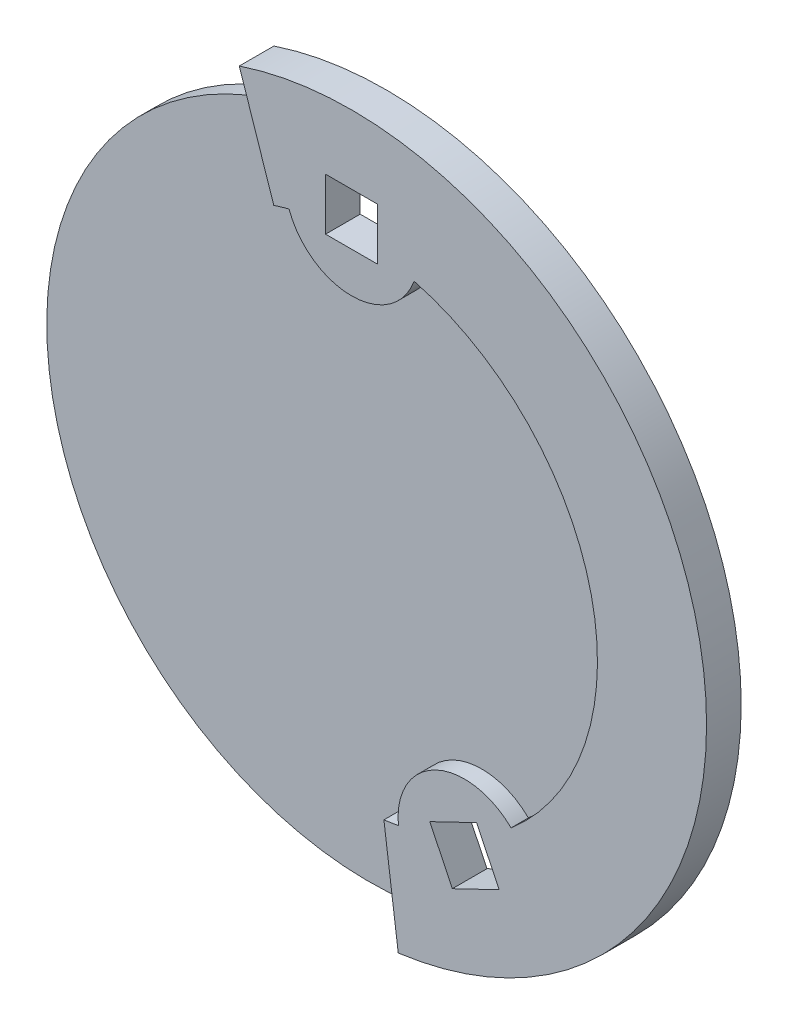
ISO-10303-21;
HEADER;
FILE_DESCRIPTION(('STEP AP214'),'2;1');
FILE_NAME('part.step','',(''),(''),'','','');
FILE_SCHEMA(('AUTOMOTIVE_DESIGN { 1 0 10303 214 1 1 1 1 }'));
ENDSEC;
DATA;
#1=APPLICATION_CONTEXT('core data for automotive mechanical design processes');
#2=APPLICATION_PROTOCOL_DEFINITION('international standard','automotive_design',2000,#1);
#3=PRODUCT_CONTEXT('',#1,'mechanical');
#4=PRODUCT('Part','Part','',(#3));
#5=PRODUCT_RELATED_PRODUCT_CATEGORY('part','',(#4));
#6=PRODUCT_DEFINITION_FORMATION('','',#4);
#7=PRODUCT_DEFINITION_CONTEXT('part definition',#1,'design');
#8=PRODUCT_DEFINITION('design','',#6,#7);
#9=PRODUCT_DEFINITION_SHAPE('','',#8);
#10=(LENGTH_UNIT() NAMED_UNIT(*) SI_UNIT(.MILLI.,.METRE.));
#11=(NAMED_UNIT(*) PLANE_ANGLE_UNIT() SI_UNIT($,.RADIAN.));
#12=(NAMED_UNIT(*) SI_UNIT($,.STERADIAN.) SOLID_ANGLE_UNIT());
#13=UNCERTAINTY_MEASURE_WITH_UNIT(LENGTH_MEASURE(1.E-05),#10,'distance_accuracy_value','');
#14=(GEOMETRIC_REPRESENTATION_CONTEXT(3) GLOBAL_UNCERTAINTY_ASSIGNED_CONTEXT((#13)) GLOBAL_UNIT_ASSIGNED_CONTEXT((#10,
#11,#12)) REPRESENTATION_CONTEXT('',''));
#15=CARTESIAN_POINT('',(0.,0.,0.));
#16=DIRECTION('',(0.,0.,1.));
#17=DIRECTION('',(1.,0.,0.));
#18=AXIS2_PLACEMENT_3D('',#15,#16,#17);
#19=CARTESIAN_POINT('',(0.,0.,1.));
#20=DIRECTION('',(-0.948679561183961,-0.316238976395711,0.));
#21=DIRECTION('',(0.316238976395711,-0.948679561183961,0.));
#22=AXIS2_PLACEMENT_3D('',#19,#20,#21);
#23=PLANE('',#22);
#24=DIRECTION('',(-0.316238976395711,0.948679561183961,0.));
#25=VECTOR('',#24,1.);
#26=CARTESIAN_POINT('',(0.,0.,0.));
#27=LINE('',#26,#25);
#28=CARTESIAN_POINT('',(-5.88204496096024,17.6454398380217,0.));
#29=VERTEX_POINT('',#28);
#30=CARTESIAN_POINT('',(-6.48289901611209,19.4479310042712,0.));
#31=VERTEX_POINT('',#30);
#32=EDGE_CURVE('E309',#29,#31,#27,.T.);
#33=ORIENTED_EDGE('',*,*,#32,.F.);
#34=DIRECTION('',(0.,0.,-1.));
#35=VECTOR('',#34,1.);
#36=CARTESIAN_POINT('',(-5.88204496096024,17.6454398380217,1.));
#37=LINE('',#36,#35);
#38=CARTESIAN_POINT('',(-5.88204496096024,17.6454398380217,1.));
#39=VERTEX_POINT('',#38);
#40=EDGE_CURVE('E311',#39,#29,#37,.T.);
#41=ORIENTED_EDGE('',*,*,#40,.F.);
#42=DIRECTION('',(0.316238976395712,-0.948679561183961,0.));
#43=VECTOR('',#42,1.);
#44=CARTESIAN_POINT('',(-4.49059346481916,13.4712497688124,1.));
#45=LINE('',#44,#43);
#46=CARTESIAN_POINT('',(-4.49059346481916,13.4712497688124,1.));
#47=VERTEX_POINT('',#46);
#48=EDGE_CURVE('E267',#39,#47,#45,.T.);
#49=ORIENTED_EDGE('',*,*,#48,.T.);
#50=DIRECTION('',(0.,0.,-1.));
#51=VECTOR('',#50,1.);
#52=CARTESIAN_POINT('',(-4.49059346481916,13.4712497688124,2.));
#53=LINE('',#52,#51);
#54=CARTESIAN_POINT('',(-4.49059346481916,13.4712497688124,2.));
#55=VERTEX_POINT('',#54);
#56=EDGE_CURVE('E234',#55,#47,#53,.T.);
#57=ORIENTED_EDGE('',*,*,#56,.F.);
#58=DIRECTION('',(0.316238976395712,-0.948679561183961,0.));
#59=VECTOR('',#58,1.);
#60=CARTESIAN_POINT('',(-4.49059346481916,13.4712497688124,2.));
#61=LINE('',#60,#59);
#62=CARTESIAN_POINT('',(-6.48289901611209,19.4479310042712,2.));
#63=VERTEX_POINT('',#62);
#64=EDGE_CURVE('E232',#63,#55,#61,.T.);
#65=ORIENTED_EDGE('',*,*,#64,.F.);
#66=DIRECTION('',(0.,0.,-1.));
#67=VECTOR('',#66,1.);
#68=CARTESIAN_POINT('',(-6.48289901611209,19.4479310042712,1.));
#69=LINE('',#68,#67);
#70=EDGE_CURVE('E314',#63,#31,#69,.T.);
#71=ORIENTED_EDGE('',*,*,#70,.T.);
#72=EDGE_LOOP('',(#33,#41,#49,#57,#65,#71));
#73=FACE_BOUND('',#72,.T.);
#74=ADVANCED_FACE('F37',(#73),#23,.T.);
#75=CARTESIAN_POINT('',(0.,0.,1.));
#76=DIRECTION('',(0.,0.,-1.));
#77=DIRECTION('',(-1.,0.,0.));
#78=AXIS2_PLACEMENT_3D('',#75,#76,#77);
#79=CYLINDRICAL_SURFACE('',#78,18.6);
#80=CARTESIAN_POINT('',(0.,0.,0.));
#81=DIRECTION('',(0.,0.,1.));
#82=DIRECTION('',(1.,0.,0.));
#83=AXIS2_PLACEMENT_3D('',#80,#81,#82);
#84=CIRCLE('',#83,18.6);
#85=CARTESIAN_POINT('',(2.35653002586721,-18.4501156158216,0.));
#86=VERTEX_POINT('',#85);
#87=EDGE_CURVE('E319',#29,#86,#84,.T.);
#88=ORIENTED_EDGE('',*,*,#87,.T.);
#89=DIRECTION('',(0.,0.,-1.));
#90=VECTOR('',#89,1.);
#91=CARTESIAN_POINT('',(2.35653002586721,-18.4501156158216,1.));
#92=LINE('',#91,#90);
#93=CARTESIAN_POINT('',(2.35653002586721,-18.4501156158216,1.));
#94=VERTEX_POINT('',#93);
#95=EDGE_CURVE('E340',#94,#86,#92,.T.);
#96=ORIENTED_EDGE('',*,*,#95,.F.);
#97=CARTESIAN_POINT('',(0.,0.,1.));
#98=DIRECTION('',(0.,0.,1.));
#99=DIRECTION('',(1.,0.,0.));
#100=AXIS2_PLACEMENT_3D('',#97,#98,#99);
#101=CIRCLE('',#100,18.6);
#102=EDGE_CURVE('E334',#39,#94,#101,.T.);
#103=ORIENTED_EDGE('',*,*,#102,.F.);
#104=ORIENTED_EDGE('',*,*,#40,.T.);
#105=EDGE_LOOP('',(#88,#96,#103,#104));
#106=FACE_BOUND('',#105,.T.);
#107=ADVANCED_FACE('F299',(#106),#79,.T.);
#108=CARTESIAN_POINT('',(0.,0.,1.));
#109=DIRECTION('',(0.991941699775358,0.126695162681033,0.));
#110=DIRECTION('',(-0.126695162681033,0.991941699775358,0.));
#111=AXIS2_PLACEMENT_3D('',#108,#109,#110);
#112=PLANE('',#111);
#113=DIRECTION('',(0.126695162681033,-0.991941699775358,0.));
#114=VECTOR('',#113,1.);
#115=CARTESIAN_POINT('',(0.,0.,0.));
#116=LINE('',#115,#114);
#117=CARTESIAN_POINT('',(2.59725083496118,-20.3348048453948,0.));
#118=VERTEX_POINT('',#117);
#119=EDGE_CURVE('E322',#86,#118,#116,.T.);
#120=ORIENTED_EDGE('',*,*,#119,.T.);
#121=DIRECTION('',(0.,0.,-1.));
#122=VECTOR('',#121,1.);
#123=CARTESIAN_POINT('',(2.59725083496118,-20.3348048453948,1.));
#124=LINE('',#123,#122);
#125=CARTESIAN_POINT('',(2.59725083496118,-20.3348048453948,1.));
#126=VERTEX_POINT('',#125);
#127=EDGE_CURVE('E336',#126,#118,#124,.T.);
#128=ORIENTED_EDGE('',*,*,#127,.F.);
#129=DIRECTION('',(0.126695162681033,-0.991941699775358,0.));
#130=VECTOR('',#129,1.);
#131=CARTESIAN_POINT('',(0.,0.,1.));
#132=LINE('',#131,#130);
#133=EDGE_CURVE('E344',#94,#126,#132,.T.);
#134=ORIENTED_EDGE('',*,*,#133,.F.);
#135=ORIENTED_EDGE('',*,*,#95,.T.);
#136=EDGE_LOOP('',(#120,#128,#134,#135));
#137=FACE_BOUND('',#136,.T.);
#138=ADVANCED_FACE('F304',(#137),#112,.F.);
#139=CARTESIAN_POINT('',(0.,0.,1.));
#140=DIRECTION('',(0.,0.,-1.));
#141=DIRECTION('',(-1.,0.,0.));
#142=AXIS2_PLACEMENT_3D('',#139,#140,#141);
#143=CYLINDRICAL_SURFACE('',#142,20.5);
#144=CARTESIAN_POINT('',(0.,0.,0.));
#145=DIRECTION('',(0.,0.,1.));
#146=DIRECTION('',(1.,0.,0.));
#147=AXIS2_PLACEMENT_3D('',#144,#145,#146);
#148=CIRCLE('',#147,20.5);
#149=EDGE_CURVE('E332',#118,#31,#148,.T.);
#150=ORIENTED_EDGE('',*,*,#149,.T.);
#151=ORIENTED_EDGE('',*,*,#70,.F.);
#152=CARTESIAN_POINT('',(0.,0.,2.));
#153=DIRECTION('',(0.,0.,1.));
#154=DIRECTION('',(1.,0.,0.));
#155=AXIS2_PLACEMENT_3D('',#152,#153,#154);
#156=CIRCLE('',#155,20.5);
#157=CARTESIAN_POINT('',(2.69669306776985,-20.3218563743139,2.));
#158=VERTEX_POINT('',#157);
#159=EDGE_CURVE('E229',#158,#63,#156,.T.);
#160=ORIENTED_EDGE('',*,*,#159,.F.);
#161=DIRECTION('',(0.,0.,-1.));
#162=VECTOR('',#161,1.);
#163=CARTESIAN_POINT('',(2.69669306776985,-20.3218563743139,2.));
#164=LINE('',#163,#162);
#165=CARTESIAN_POINT('',(2.69669306776985,-20.3218563743139,1.));
#166=VERTEX_POINT('',#165);
#167=EDGE_CURVE('E258',#158,#166,#164,.T.);
#168=ORIENTED_EDGE('',*,*,#167,.T.);
#169=CARTESIAN_POINT('',(0.,0.,1.));
#170=DIRECTION('',(0.,0.,1.));
#171=DIRECTION('',(1.,0.,0.));
#172=AXIS2_PLACEMENT_3D('',#169,#170,#171);
#173=CIRCLE('',#172,20.5);
#174=EDGE_CURVE('E337',#126,#166,#173,.T.);
#175=ORIENTED_EDGE('',*,*,#174,.F.);
#176=ORIENTED_EDGE('',*,*,#127,.T.);
#177=EDGE_LOOP('',(#150,#151,#160,#168,#175,#176));
#178=FACE_BOUND('',#177,.T.);
#179=ADVANCED_FACE('F392',(#178),#143,.T.);
#180=CARTESIAN_POINT('',(0.,0.,1.));
#181=DIRECTION('',(0.,0.,1.));
#182=DIRECTION('',(1.,0.,0.));
#183=AXIS2_PLACEMENT_3D('',#180,#181,#182);
#184=PLANE('',#183);
#185=ORIENTED_EDGE('',*,*,#48,.F.);
#186=ORIENTED_EDGE('',*,*,#102,.T.);
#187=ORIENTED_EDGE('',*,*,#133,.T.);
#188=ORIENTED_EDGE('',*,*,#174,.T.);
#189=DIRECTION('',(0.131546003305846,-0.991310067039702,0.));
#190=VECTOR('',#189,1.);
#191=CARTESIAN_POINT('',(1.86795324694304,-14.0766029519639,1.));
#192=LINE('',#191,#190);
#193=CARTESIAN_POINT('',(1.86795324694304,-14.0766029519639,1.));
#194=VERTEX_POINT('',#193);
#195=EDGE_CURVE('E219',#194,#166,#192,.T.);
#196=ORIENTED_EDGE('',*,*,#195,.F.);
#197=CARTESIAN_POINT('',(0.,0.,1.));
#198=DIRECTION('',(0.,0.,-1.));
#199=DIRECTION('',(1.,0.,0.));
#200=AXIS2_PLACEMENT_3D('',#197,#198,#199);
#201=CIRCLE('',#200,14.2000000000002);
#202=CARTESIAN_POINT('',(2.70630370509862,-13.9397245401684,1.));
#203=VERTEX_POINT('',#202);
#204=EDGE_CURVE('E246',#203,#194,#201,.T.);
#205=ORIENTED_EDGE('',*,*,#204,.F.);
#206=CARTESIAN_POINT('',(6.52092011060211,-13.5408301350134,1.));
#207=DIRECTION('',(0.,0.,1.));
#208=DIRECTION('',(1.,0.,0.));
#209=AXIS2_PLACEMENT_3D('',#206,#207,#208);
#210=CIRCLE('',#209,3.83541589239033);
#211=CARTESIAN_POINT('',(9.21116274156859,-10.8071495292858,1.));
#212=VERTEX_POINT('',#211);
#213=EDGE_CURVE('E243',#212,#203,#210,.T.);
#214=ORIENTED_EDGE('',*,*,#213,.F.);
#215=CARTESIAN_POINT('',(0.,0.,1.));
#216=DIRECTION('',(0.,0.,-1.));
#217=DIRECTION('',(1.,0.,0.));
#218=AXIS2_PLACEMENT_3D('',#215,#216,#217);
#219=CIRCLE('',#218,14.2000000000002);
#220=CARTESIAN_POINT('',(3.60992442037415,13.733479008583,1.));
#221=VERTEX_POINT('',#220);
#222=EDGE_CURVE('E240',#221,#212,#219,.T.);
#223=ORIENTED_EDGE('',*,*,#222,.F.);
#224=CARTESIAN_POINT('',(3.90616358703078E-12,15.0291875972769,1.));
#225=DIRECTION('',(0.,0.,1.));
#226=DIRECTION('',(1.,0.,0.));
#227=AXIS2_PLACEMENT_3D('',#224,#225,#226);
#228=CIRCLE('',#227,3.83541589239035);
#229=CARTESIAN_POINT('',(-3.60992442036701,13.7334790085849,1.));
#230=VERTEX_POINT('',#229);
#231=EDGE_CURVE('E237',#230,#221,#228,.T.);
#232=ORIENTED_EDGE('',*,*,#231,.F.);
#233=CARTESIAN_POINT('',(0.,0.,1.));
#234=DIRECTION('',(0.,0.,-1.));
#235=DIRECTION('',(1.,0.,0.));
#236=AXIS2_PLACEMENT_3D('',#233,#234,#235);
#237=CIRCLE('',#236,14.2000000000002);
#238=EDGE_CURVE('E208',#47,#230,#237,.T.);
#239=ORIENTED_EDGE('',*,*,#238,.F.);
#240=EDGE_LOOP('',(#185,#186,#187,#188,#196,#205,#214,#223,#232,#239));
#241=FACE_BOUND('',#240,.T.);
#242=ADVANCED_FACE('F372',(#241),#184,.T.);
#243=CARTESIAN_POINT('',(0.,0.,0.));
#244=DIRECTION('',(0.,0.,1.));
#245=DIRECTION('',(1.,0.,0.));
#246=AXIS2_PLACEMENT_3D('',#243,#244,#245);
#247=PLANE('',#246);
#248=DIRECTION('',(-0.90096886790242,-0.433883739117555,0.));
#249=VECTOR('',#248,1.);
#250=CARTESIAN_POINT('',(5.82029241742415,-15.5431090455452,0.));
#251=LINE('',#250,#249);
#252=CARTESIAN_POINT('',(8.523199021134,-14.2414578281913,0.));
#253=VERTEX_POINT('',#252);
#254=CARTESIAN_POINT('',(5.82029241742415,-15.5431090455452,0.));
#255=VERTEX_POINT('',#254);
#256=EDGE_CURVE('E178',#253,#255,#251,.T.);
#257=ORIENTED_EDGE('',*,*,#256,.F.);
#258=DIRECTION('',(0.433883739117555,-0.900968867902421,0.));
#259=VECTOR('',#258,1.);
#260=CARTESIAN_POINT('',(8.523199021134,-14.2414578281913,0.));
#261=LINE('',#260,#259);
#262=CARTESIAN_POINT('',(7.22154780378009,-11.5385512244815,0.));
#263=VERTEX_POINT('',#262);
#264=EDGE_CURVE('E51',#263,#253,#261,.T.);
#265=ORIENTED_EDGE('',*,*,#264,.F.);
#266=DIRECTION('',(0.90096886790242,0.433883739117556,0.));
#267=VECTOR('',#266,1.);
#268=CARTESIAN_POINT('',(7.22154780378009,-11.5385512244815,0.));
#269=LINE('',#268,#267);
#270=CARTESIAN_POINT('',(4.51864120007024,-12.8402024418354,0.));
#271=VERTEX_POINT('',#270);
#272=EDGE_CURVE('E185',#271,#263,#269,.T.);
#273=ORIENTED_EDGE('',*,*,#272,.F.);
#274=DIRECTION('',(-0.433883739117555,0.900968867902421,0.));
#275=VECTOR('',#274,1.);
#276=CARTESIAN_POINT('',(4.51864120007024,-12.8402024418354,0.));
#277=LINE('',#276,#275);
#278=EDGE_CURVE('E169',#255,#271,#277,.T.);
#279=ORIENTED_EDGE('',*,*,#278,.F.);
#280=EDGE_LOOP('',(#257,#265,#273,#279));
#281=FACE_BOUND('',#280,.T.);
#282=DIRECTION('',(-1.,0.,0.));
#283=VECTOR('',#282,1.);
#284=CARTESIAN_POINT('',(-1.49999999999752,13.5291875972754,0.));
#285=LINE('',#284,#283);
#286=CARTESIAN_POINT('',(1.50000000000534,13.5291875972755,0.));
#287=VERTEX_POINT('',#286);
#288=CARTESIAN_POINT('',(-1.49999999999752,13.5291875972754,0.));
#289=VERTEX_POINT('',#288);
#290=EDGE_CURVE('E196',#287,#289,#285,.T.);
#291=ORIENTED_EDGE('',*,*,#290,.F.);
#292=DIRECTION('',(0.,-1.,0.));
#293=VECTOR('',#292,1.);
#294=CARTESIAN_POINT('',(1.50000000000534,13.5291875972755,0.));
#295=LINE('',#294,#293);
#296=CARTESIAN_POINT('',(1.50000000000533,16.5291875972783,0.));
#297=VERTEX_POINT('',#296);
#298=EDGE_CURVE('E192',#297,#287,#295,.T.);
#299=ORIENTED_EDGE('',*,*,#298,.F.);
#300=DIRECTION('',(1.,0.,0.));
#301=VECTOR('',#300,1.);
#302=CARTESIAN_POINT('',(1.50000000000533,16.5291875972783,0.));
#303=LINE('',#302,#301);
#304=CARTESIAN_POINT('',(-1.49999999999753,16.5291875972783,0.));
#305=VERTEX_POINT('',#304);
#306=EDGE_CURVE('E202',#305,#297,#303,.T.);
#307=ORIENTED_EDGE('',*,*,#306,.F.);
#308=DIRECTION('',(0.,1.,0.));
#309=VECTOR('',#308,1.);
#310=CARTESIAN_POINT('',(-1.49999999999753,16.5291875972783,0.));
#311=LINE('',#310,#309);
#312=EDGE_CURVE('E199',#289,#305,#311,.T.);
#313=ORIENTED_EDGE('',*,*,#312,.F.);
#314=EDGE_LOOP('',(#291,#299,#307,#313));
#315=FACE_BOUND('',#314,.T.);
#316=ORIENTED_EDGE('',*,*,#32,.T.);
#317=ORIENTED_EDGE('',*,*,#149,.F.);
#318=ORIENTED_EDGE('',*,*,#119,.F.);
#319=ORIENTED_EDGE('',*,*,#87,.F.);
#320=EDGE_LOOP('',(#316,#317,#318,#319));
#321=FACE_BOUND('',#320,.T.);
#322=ADVANCED_FACE('F182',(#281,#315,#321),#247,.F.);
#323=CARTESIAN_POINT('',(0.,0.,2.));
#324=DIRECTION('',(0.,0.,-1.));
#325=DIRECTION('',(-1.,0.,0.));
#326=AXIS2_PLACEMENT_3D('',#323,#324,#325);
#327=CYLINDRICAL_SURFACE('',#326,14.2000000000002);
#328=ORIENTED_EDGE('',*,*,#238,.T.);
#329=DIRECTION('',(0.,0.,-1.));
#330=VECTOR('',#329,1.);
#331=CARTESIAN_POINT('',(-3.60992442036701,13.7334790085849,2.));
#332=LINE('',#331,#330);
#333=CARTESIAN_POINT('',(-3.60992442036701,13.7334790085849,2.));
#334=VERTEX_POINT('',#333);
#335=EDGE_CURVE('E320',#334,#230,#332,.T.);
#336=ORIENTED_EDGE('',*,*,#335,.F.);
#337=CARTESIAN_POINT('',(0.,0.,2.));
#338=DIRECTION('',(0.,0.,-1.));
#339=DIRECTION('',(1.,0.,0.));
#340=AXIS2_PLACEMENT_3D('',#337,#338,#339);
#341=CIRCLE('',#340,14.2000000000002);
#342=EDGE_CURVE('E215',#55,#334,#341,.T.);
#343=ORIENTED_EDGE('',*,*,#342,.F.);
#344=ORIENTED_EDGE('',*,*,#56,.T.);
#345=EDGE_LOOP('',(#328,#336,#343,#344));
#346=FACE_BOUND('',#345,.T.);
#347=ADVANCED_FACE('F387',(#346),#327,.F.);
#348=CARTESIAN_POINT('',(3.90616358703078E-12,15.0291875972769,2.));
#349=DIRECTION('',(0.,0.,-1.));
#350=DIRECTION('',(-1.,0.,0.));
#351=AXIS2_PLACEMENT_3D('',#348,#349,#350);
#352=CYLINDRICAL_SURFACE('',#351,3.83541589239035);
#353=ORIENTED_EDGE('',*,*,#231,.T.);
#354=DIRECTION('',(0.,0.,-1.));
#355=VECTOR('',#354,1.);
#356=CARTESIAN_POINT('',(3.60992442037415,13.733479008583,2.));
#357=LINE('',#356,#355);
#358=CARTESIAN_POINT('',(3.60992442037415,13.733479008583,2.));
#359=VERTEX_POINT('',#358);
#360=EDGE_CURVE('E325',#359,#221,#357,.T.);
#361=ORIENTED_EDGE('',*,*,#360,.F.);
#362=CARTESIAN_POINT('',(3.90616358703078E-12,15.0291875972769,2.));
#363=DIRECTION('',(0.,0.,1.));
#364=DIRECTION('',(1.,0.,0.));
#365=AXIS2_PLACEMENT_3D('',#362,#363,#364);
#366=CIRCLE('',#365,3.83541589239035);
#367=EDGE_CURVE('E218',#334,#359,#366,.T.);
#368=ORIENTED_EDGE('',*,*,#367,.F.);
#369=ORIENTED_EDGE('',*,*,#335,.T.);
#370=EDGE_LOOP('',(#353,#361,#368,#369));
#371=FACE_BOUND('',#370,.T.);
#372=ADVANCED_FACE('F382',(#371),#352,.T.);
#373=CARTESIAN_POINT('',(0.,0.,2.));
#374=DIRECTION('',(0.,0.,-1.));
#375=DIRECTION('',(-1.,0.,0.));
#376=AXIS2_PLACEMENT_3D('',#373,#374,#375);
#377=CYLINDRICAL_SURFACE('',#376,14.2000000000002);
#378=ORIENTED_EDGE('',*,*,#222,.T.);
#379=DIRECTION('',(0.,0.,-1.));
#380=VECTOR('',#379,1.);
#381=CARTESIAN_POINT('',(9.21116274156859,-10.8071495292858,2.));
#382=LINE('',#381,#380);
#383=CARTESIAN_POINT('',(9.21116274156859,-10.8071495292858,2.));
#384=VERTEX_POINT('',#383);
#385=EDGE_CURVE('E357',#384,#212,#382,.T.);
#386=ORIENTED_EDGE('',*,*,#385,.F.);
#387=CARTESIAN_POINT('',(0.,0.,2.));
#388=DIRECTION('',(0.,0.,-1.));
#389=DIRECTION('',(1.,0.,0.));
#390=AXIS2_PLACEMENT_3D('',#387,#388,#389);
#391=CIRCLE('',#390,14.2000000000002);
#392=EDGE_CURVE('E221',#359,#384,#391,.T.);
#393=ORIENTED_EDGE('',*,*,#392,.F.);
#394=ORIENTED_EDGE('',*,*,#360,.T.);
#395=EDGE_LOOP('',(#378,#386,#393,#394));
#396=FACE_BOUND('',#395,.T.);
#397=ADVANCED_FACE('F379',(#396),#377,.F.);
#398=CARTESIAN_POINT('',(6.52092011060211,-13.5408301350134,2.));
#399=DIRECTION('',(0.,0.,-1.));
#400=DIRECTION('',(-1.,0.,0.));
#401=AXIS2_PLACEMENT_3D('',#398,#399,#400);
#402=CYLINDRICAL_SURFACE('',#401,3.83541589239033);
#403=ORIENTED_EDGE('',*,*,#213,.T.);
#404=DIRECTION('',(0.,0.,-1.));
#405=VECTOR('',#404,1.);
#406=CARTESIAN_POINT('',(2.70630370509862,-13.9397245401684,2.));
#407=LINE('',#406,#405);
#408=CARTESIAN_POINT('',(2.70630370509862,-13.9397245401684,2.));
#409=VERTEX_POINT('',#408);
#410=EDGE_CURVE('E360',#409,#203,#407,.T.);
#411=ORIENTED_EDGE('',*,*,#410,.F.);
#412=CARTESIAN_POINT('',(6.52092011060211,-13.5408301350134,2.));
#413=DIRECTION('',(0.,0.,1.));
#414=DIRECTION('',(1.,0.,0.));
#415=AXIS2_PLACEMENT_3D('',#412,#413,#414);
#416=CIRCLE('',#415,3.83541589239033);
#417=EDGE_CURVE('E223',#384,#409,#416,.T.);
#418=ORIENTED_EDGE('',*,*,#417,.F.);
#419=ORIENTED_EDGE('',*,*,#385,.T.);
#420=EDGE_LOOP('',(#403,#411,#418,#419));
#421=FACE_BOUND('',#420,.T.);
#422=ADVANCED_FACE('F374',(#421),#402,.T.);
#423=CARTESIAN_POINT('',(0.,0.,2.));
#424=DIRECTION('',(0.,0.,-1.));
#425=DIRECTION('',(-1.,0.,0.));
#426=AXIS2_PLACEMENT_3D('',#423,#424,#425);
#427=CYLINDRICAL_SURFACE('',#426,14.2000000000002);
#428=ORIENTED_EDGE('',*,*,#204,.T.);
#429=DIRECTION('',(0.,0.,-1.));
#430=VECTOR('',#429,1.);
#431=CARTESIAN_POINT('',(1.86795324694304,-14.0766029519639,2.));
#432=LINE('',#431,#430);
#433=CARTESIAN_POINT('',(1.86795324694304,-14.0766029519639,2.));
#434=VERTEX_POINT('',#433);
#435=EDGE_CURVE('E261',#434,#194,#432,.T.);
#436=ORIENTED_EDGE('',*,*,#435,.F.);
#437=CARTESIAN_POINT('',(0.,0.,2.));
#438=DIRECTION('',(0.,0.,-1.));
#439=DIRECTION('',(1.,0.,0.));
#440=AXIS2_PLACEMENT_3D('',#437,#438,#439);
#441=CIRCLE('',#440,14.2000000000002);
#442=EDGE_CURVE('E225',#409,#434,#441,.T.);
#443=ORIENTED_EDGE('',*,*,#442,.F.);
#444=ORIENTED_EDGE('',*,*,#410,.T.);
#445=EDGE_LOOP('',(#428,#436,#443,#444));
#446=FACE_BOUND('',#445,.T.);
#447=ADVANCED_FACE('F370',(#446),#427,.F.);
#448=CARTESIAN_POINT('',(1.86795324694304,-14.0766029519639,2.));
#449=DIRECTION('',(0.991310067039702,0.131546003305846,0.));
#450=DIRECTION('',(-0.131546003305846,0.991310067039702,0.));
#451=AXIS2_PLACEMENT_3D('',#448,#449,#450);
#452=PLANE('',#451);
#453=ORIENTED_EDGE('',*,*,#195,.T.);
#454=ORIENTED_EDGE('',*,*,#167,.F.);
#455=DIRECTION('',(0.131546003305846,-0.991310067039702,0.));
#456=VECTOR('',#455,1.);
#457=CARTESIAN_POINT('',(1.86795324694304,-14.0766029519639,2.));
#458=LINE('',#457,#456);
#459=EDGE_CURVE('E227',#434,#158,#458,.T.);
#460=ORIENTED_EDGE('',*,*,#459,.F.);
#461=ORIENTED_EDGE('',*,*,#435,.T.);
#462=EDGE_LOOP('',(#453,#454,#460,#461));
#463=FACE_BOUND('',#462,.T.);
#464=ADVANCED_FACE('F366',(#463),#452,.F.);
#465=CARTESIAN_POINT('',(0.,0.,2.));
#466=DIRECTION('',(0.,0.,1.));
#467=DIRECTION('',(1.,0.,0.));
#468=AXIS2_PLACEMENT_3D('',#465,#466,#467);
#469=PLANE('',#468);
#470=DIRECTION('',(-0.433883739117555,0.900968867902421,0.));
#471=VECTOR('',#470,1.);
#472=CARTESIAN_POINT('',(1.35145330185137,0.650825608675243,2.));
#473=LINE('',#472,#471);
#474=CARTESIAN_POINT('',(8.523199021134,-14.2414578281913,2.));
#475=VERTEX_POINT('',#474);
#476=CARTESIAN_POINT('',(7.22154780378009,-11.5385512244815,2.));
#477=VERTEX_POINT('',#476);
#478=EDGE_CURVE('E11',#475,#477,#473,.T.);
#479=ORIENTED_EDGE('',*,*,#478,.F.);
#480=DIRECTION('',(0.900968867902421,0.433883739117555,0.));
#481=VECTOR('',#480,1.);
#482=CARTESIAN_POINT('',(7.17174571928263,-14.8922834368666,2.));
#483=LINE('',#482,#481);
#484=CARTESIAN_POINT('',(5.82029241742415,-15.5431090455452,2.));
#485=VERTEX_POINT('',#484);
#486=EDGE_CURVE('E274',#485,#475,#483,.T.);
#487=ORIENTED_EDGE('',*,*,#486,.F.);
#488=DIRECTION('',(0.433883739117555,-0.900968867902421,0.));
#489=VECTOR('',#488,1.);
#490=CARTESIAN_POINT('',(-1.35145330185848,-0.650825608678668,2.));
#491=LINE('',#490,#489);
#492=CARTESIAN_POINT('',(4.51864120007024,-12.8402024418354,2.));
#493=VERTEX_POINT('',#492);
#494=EDGE_CURVE('E172',#493,#485,#491,.T.);
#495=ORIENTED_EDGE('',*,*,#494,.F.);
#496=DIRECTION('',(-0.90096886790242,-0.433883739117556,0.));
#497=VECTOR('',#496,1.);
#498=CARTESIAN_POINT('',(5.87009450192873,-12.1893768331567,2.));
#499=LINE('',#498,#497);
#500=EDGE_CURVE('E44',#477,#493,#499,.T.);
#501=ORIENTED_EDGE('',*,*,#500,.F.);
#502=EDGE_LOOP('',(#479,#487,#495,#501));
#503=FACE_BOUND('',#502,.T.);
#504=DIRECTION('',(0.,1.,0.));
#505=VECTOR('',#504,1.);
#506=CARTESIAN_POINT('',(1.50000000000538,0.,2.));
#507=LINE('',#506,#505);
#508=CARTESIAN_POINT('',(1.50000000000534,13.5291875972755,2.));
#509=VERTEX_POINT('',#508);
#510=CARTESIAN_POINT('',(1.50000000000533,16.5291875972783,2.));
#511=VERTEX_POINT('',#510);
#512=EDGE_CURVE('E272',#509,#511,#507,.T.);
#513=ORIENTED_EDGE('',*,*,#512,.F.);
#514=DIRECTION('',(1.,0.,0.));
#515=VECTOR('',#514,1.);
#516=CARTESIAN_POINT('',(0.,13.5291875972755,2.));
#517=LINE('',#516,#515);
#518=CARTESIAN_POINT('',(-1.49999999999752,13.5291875972754,2.));
#519=VERTEX_POINT('',#518);
#520=EDGE_CURVE('E264',#519,#509,#517,.T.);
#521=ORIENTED_EDGE('',*,*,#520,.F.);
#522=DIRECTION('',(0.,-1.,0.));
#523=VECTOR('',#522,1.);
#524=CARTESIAN_POINT('',(-1.49999999999749,0.,2.));
#525=LINE('',#524,#523);
#526=CARTESIAN_POINT('',(-1.49999999999753,16.5291875972783,2.));
#527=VERTEX_POINT('',#526);
#528=EDGE_CURVE('E266',#527,#519,#525,.T.);
#529=ORIENTED_EDGE('',*,*,#528,.F.);
#530=DIRECTION('',(-1.,0.,0.));
#531=VECTOR('',#530,1.);
#532=CARTESIAN_POINT('',(0.,16.5291875972783,2.));
#533=LINE('',#532,#531);
#534=EDGE_CURVE('E270',#511,#527,#533,.T.);
#535=ORIENTED_EDGE('',*,*,#534,.F.);
#536=EDGE_LOOP('',(#513,#521,#529,#535));
#537=FACE_BOUND('',#536,.T.);
#538=ORIENTED_EDGE('',*,*,#342,.T.);
#539=ORIENTED_EDGE('',*,*,#367,.T.);
#540=ORIENTED_EDGE('',*,*,#392,.T.);
#541=ORIENTED_EDGE('',*,*,#417,.T.);
#542=ORIENTED_EDGE('',*,*,#442,.T.);
#543=ORIENTED_EDGE('',*,*,#459,.T.);
#544=ORIENTED_EDGE('',*,*,#159,.T.);
#545=ORIENTED_EDGE('',*,*,#64,.T.);
#546=EDGE_LOOP('',(#538,#539,#540,#541,#542,#543,#544,#545));
#547=FACE_BOUND('',#546,.T.);
#548=ADVANCED_FACE('F282',(#503,#537,#547),#469,.T.);
#549=CARTESIAN_POINT('',(1.50000000000534,13.5291875972755,2.000025));
#550=DIRECTION('',(1.,0.,0.));
#551=DIRECTION('',(0.,1.,0.));
#552=AXIS2_PLACEMENT_3D('',#549,#550,#551);
#553=PLANE('',#552);
#554=ORIENTED_EDGE('',*,*,#512,.T.);
#555=DIRECTION('',(0.,0.,-1.));
#556=VECTOR('',#555,1.);
#557=CARTESIAN_POINT('',(1.50000000000533,16.5291875972783,2.000025));
#558=LINE('',#557,#556);
#559=EDGE_CURVE('E206',#511,#297,#558,.T.);
#560=ORIENTED_EDGE('',*,*,#559,.T.);
#561=ORIENTED_EDGE('',*,*,#298,.T.);
#562=DIRECTION('',(0.,0.,-1.));
#563=VECTOR('',#562,1.);
#564=CARTESIAN_POINT('',(1.50000000000534,13.5291875972755,2.000025));
#565=LINE('',#564,#563);
#566=EDGE_CURVE('E205',#509,#287,#565,.T.);
#567=ORIENTED_EDGE('',*,*,#566,.F.);
#568=EDGE_LOOP('',(#554,#560,#561,#567));
#569=FACE_BOUND('',#568,.T.);
#570=ADVANCED_FACE('F421',(#569),#553,.F.);
#571=CARTESIAN_POINT('',(1.50000000000533,16.5291875972783,2.000025));
#572=DIRECTION('',(0.,1.,0.));
#573=DIRECTION('',(-1.,0.,0.));
#574=AXIS2_PLACEMENT_3D('',#571,#572,#573);
#575=PLANE('',#574);
#576=ORIENTED_EDGE('',*,*,#534,.T.);
#577=DIRECTION('',(0.,0.,-1.));
#578=VECTOR('',#577,1.);
#579=CARTESIAN_POINT('',(-1.49999999999753,16.5291875972783,2.000025));
#580=LINE('',#579,#578);
#581=EDGE_CURVE('E209',#527,#305,#580,.T.);
#582=ORIENTED_EDGE('',*,*,#581,.T.);
#583=ORIENTED_EDGE('',*,*,#306,.T.);
#584=ORIENTED_EDGE('',*,*,#559,.F.);
#585=EDGE_LOOP('',(#576,#582,#583,#584));
#586=FACE_BOUND('',#585,.T.);
#587=ADVANCED_FACE('F423',(#586),#575,.F.);
#588=CARTESIAN_POINT('',(-1.49999999999753,16.5291875972783,2.000025));
#589=DIRECTION('',(-1.,0.,0.));
#590=DIRECTION('',(0.,-1.,0.));
#591=AXIS2_PLACEMENT_3D('',#588,#589,#590);
#592=PLANE('',#591);
#593=ORIENTED_EDGE('',*,*,#528,.T.);
#594=DIRECTION('',(0.,0.,-1.));
#595=VECTOR('',#594,1.);
#596=CARTESIAN_POINT('',(-1.49999999999752,13.5291875972754,2.000025));
#597=LINE('',#596,#595);
#598=EDGE_CURVE('E211',#519,#289,#597,.T.);
#599=ORIENTED_EDGE('',*,*,#598,.T.);
#600=ORIENTED_EDGE('',*,*,#312,.T.);
#601=ORIENTED_EDGE('',*,*,#581,.F.);
#602=EDGE_LOOP('',(#593,#599,#600,#601));
#603=FACE_BOUND('',#602,.T.);
#604=ADVANCED_FACE('F293',(#603),#592,.F.);
#605=CARTESIAN_POINT('',(-1.49999999999752,13.5291875972754,2.000025));
#606=DIRECTION('',(0.,-1.,0.));
#607=DIRECTION('',(1.,0.,0.));
#608=AXIS2_PLACEMENT_3D('',#605,#606,#607);
#609=PLANE('',#608);
#610=ORIENTED_EDGE('',*,*,#520,.T.);
#611=ORIENTED_EDGE('',*,*,#566,.T.);
#612=ORIENTED_EDGE('',*,*,#290,.T.);
#613=ORIENTED_EDGE('',*,*,#598,.F.);
#614=EDGE_LOOP('',(#610,#611,#612,#613));
#615=FACE_BOUND('',#614,.T.);
#616=ADVANCED_FACE('F286',(#615),#609,.F.);
#617=CARTESIAN_POINT('',(8.523199021134,-14.2414578281913,2.000025));
#618=DIRECTION('',(0.900968867902421,0.433883739117555,0.));
#619=DIRECTION('',(-0.433883739117555,0.900968867902421,0.));
#620=AXIS2_PLACEMENT_3D('',#617,#618,#619);
#621=PLANE('',#620);
#622=ORIENTED_EDGE('',*,*,#478,.T.);
#623=DIRECTION('',(0.,0.,-1.));
#624=VECTOR('',#623,1.);
#625=CARTESIAN_POINT('',(7.22154780378009,-11.5385512244815,2.000025));
#626=LINE('',#625,#624);
#627=EDGE_CURVE('E190',#477,#263,#626,.T.);
#628=ORIENTED_EDGE('',*,*,#627,.T.);
#629=ORIENTED_EDGE('',*,*,#264,.T.);
#630=DIRECTION('',(0.,0.,-1.));
#631=VECTOR('',#630,1.);
#632=CARTESIAN_POINT('',(8.523199021134,-14.2414578281913,2.000025));
#633=LINE('',#632,#631);
#634=EDGE_CURVE('E175',#475,#253,#633,.T.);
#635=ORIENTED_EDGE('',*,*,#634,.F.);
#636=EDGE_LOOP('',(#622,#628,#629,#635));
#637=FACE_BOUND('',#636,.T.);
#638=ADVANCED_FACE('F284',(#637),#621,.F.);
#639=CARTESIAN_POINT('',(7.22154780378009,-11.5385512244815,2.000025));
#640=DIRECTION('',(-0.433883739117555,0.90096886790242,0.));
#641=DIRECTION('',(-0.90096886790242,-0.433883739117556,0.));
#642=AXIS2_PLACEMENT_3D('',#639,#640,#641);
#643=PLANE('',#642);
#644=ORIENTED_EDGE('',*,*,#500,.T.);
#645=DIRECTION('',(0.,0.,-1.));
#646=VECTOR('',#645,1.);
#647=CARTESIAN_POINT('',(4.51864120007024,-12.8402024418354,2.000025));
#648=LINE('',#647,#646);
#649=EDGE_CURVE('E174',#493,#271,#648,.T.);
#650=ORIENTED_EDGE('',*,*,#649,.T.);
#651=ORIENTED_EDGE('',*,*,#272,.T.);
#652=ORIENTED_EDGE('',*,*,#627,.F.);
#653=EDGE_LOOP('',(#644,#650,#651,#652));
#654=FACE_BOUND('',#653,.T.);
#655=ADVANCED_FACE('F279',(#654),#643,.F.);
#656=CARTESIAN_POINT('',(4.51864120007024,-12.8402024418354,2.000025));
#657=DIRECTION('',(-0.900968867902421,-0.433883739117555,0.));
#658=DIRECTION('',(0.433883739117555,-0.900968867902421,0.));
#659=AXIS2_PLACEMENT_3D('',#656,#657,#658);
#660=PLANE('',#659);
#661=ORIENTED_EDGE('',*,*,#494,.T.);
#662=DIRECTION('',(0.,0.,-1.));
#663=VECTOR('',#662,1.);
#664=CARTESIAN_POINT('',(5.82029241742415,-15.5431090455452,2.000025));
#665=LINE('',#664,#663);
#666=EDGE_CURVE('E59',#485,#255,#665,.T.);
#667=ORIENTED_EDGE('',*,*,#666,.T.);
#668=ORIENTED_EDGE('',*,*,#278,.T.);
#669=ORIENTED_EDGE('',*,*,#649,.F.);
#670=EDGE_LOOP('',(#661,#667,#668,#669));
#671=FACE_BOUND('',#670,.T.);
#672=ADVANCED_FACE('F166',(#671),#660,.F.);
#673=CARTESIAN_POINT('',(5.82029241742415,-15.5431090455452,2.000025));
#674=DIRECTION('',(0.433883739117555,-0.90096886790242,0.));
#675=DIRECTION('',(0.900968867902421,0.433883739117555,0.));
#676=AXIS2_PLACEMENT_3D('',#673,#674,#675);
#677=PLANE('',#676);
#678=ORIENTED_EDGE('',*,*,#486,.T.);
#679=ORIENTED_EDGE('',*,*,#634,.T.);
#680=ORIENTED_EDGE('',*,*,#256,.T.);
#681=ORIENTED_EDGE('',*,*,#666,.F.);
#682=EDGE_LOOP('',(#678,#679,#680,#681));
#683=FACE_BOUND('',#682,.T.);
#684=ADVANCED_FACE('F179',(#683),#677,.F.);
#685=CLOSED_SHELL('',(#74,#107,#138,#179,#242,#322,#347,#372,#397,#422,#447,#464,#548,#570,#587,
#604,#616,#638,#655,#672,#684));
#686=MANIFOLD_SOLID_BREP('B2',#685);
#687=ADVANCED_BREP_SHAPE_REPRESENTATION('',(#18,#686),#14);
#688=SHAPE_DEFINITION_REPRESENTATION(#9,#687);
ENDSEC;
END-ISO-10303-21;
